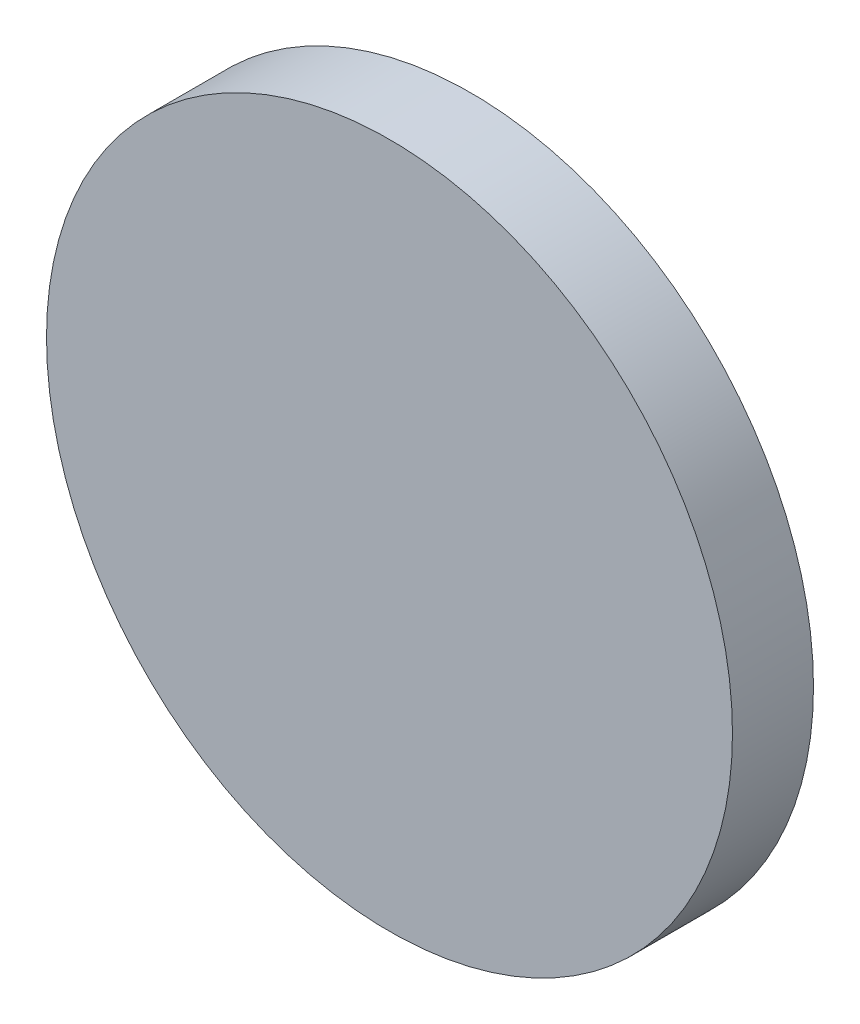
ISO-10303-21;
HEADER;
FILE_DESCRIPTION(('STEP AP214'),'2;1');
FILE_NAME('part.step','',(''),(''),'','','');
FILE_SCHEMA(('AUTOMOTIVE_DESIGN { 1 0 10303 214 1 1 1 1 }'));
ENDSEC;
DATA;
#1=APPLICATION_CONTEXT('core data for automotive mechanical design processes');
#2=APPLICATION_PROTOCOL_DEFINITION('international standard','automotive_design',2000,#1);
#3=PRODUCT_CONTEXT('',#1,'mechanical');
#4=PRODUCT('Part','Part','',(#3));
#5=PRODUCT_RELATED_PRODUCT_CATEGORY('part','',(#4));
#6=PRODUCT_DEFINITION_FORMATION('','',#4);
#7=PRODUCT_DEFINITION_CONTEXT('part definition',#1,'design');
#8=PRODUCT_DEFINITION('design','',#6,#7);
#9=PRODUCT_DEFINITION_SHAPE('','',#8);
#10=(LENGTH_UNIT() NAMED_UNIT(*) SI_UNIT(.MILLI.,.METRE.));
#11=(NAMED_UNIT(*) PLANE_ANGLE_UNIT() SI_UNIT($,.RADIAN.));
#12=(NAMED_UNIT(*) SI_UNIT($,.STERADIAN.) SOLID_ANGLE_UNIT());
#13=UNCERTAINTY_MEASURE_WITH_UNIT(LENGTH_MEASURE(1.E-05),#10,'distance_accuracy_value','');
#14=(GEOMETRIC_REPRESENTATION_CONTEXT(3) GLOBAL_UNCERTAINTY_ASSIGNED_CONTEXT((#13)) GLOBAL_UNIT_ASSIGNED_CONTEXT((#10,
#11,#12)) REPRESENTATION_CONTEXT('',''));
#15=CARTESIAN_POINT('',(0.,0.,0.));
#16=DIRECTION('',(0.,0.,1.));
#17=DIRECTION('',(1.,0.,0.));
#18=AXIS2_PLACEMENT_3D('',#15,#16,#17);
#19=CARTESIAN_POINT('',(0.,0.,3.));
#20=DIRECTION('',(0.,0.,-1.));
#21=DIRECTION('',(-1.,0.,0.));
#22=AXIS2_PLACEMENT_3D('',#19,#20,#21);
#23=CYLINDRICAL_SURFACE('',#22,12.7);
#24=CARTESIAN_POINT('',(0.,0.,3.));
#25=DIRECTION('',(0.,0.,1.));
#26=DIRECTION('',(1.,0.,0.));
#27=AXIS2_PLACEMENT_3D('',#24,#25,#26);
#28=CIRCLE('',#27,12.7);
#29=CARTESIAN_POINT('',(12.7,0.,3.));
#30=VERTEX_POINT('',#29);
#31=EDGE_CURVE('E10',#30,#30,#28,.T.);
#32=ORIENTED_EDGE('',*,*,#31,.F.);
#33=EDGE_LOOP('',(#32));
#34=FACE_BOUND('',#33,.T.);
#35=CARTESIAN_POINT('',(0.,0.,0.));
#36=DIRECTION('',(0.,0.,1.));
#37=DIRECTION('',(1.,0.,0.));
#38=AXIS2_PLACEMENT_3D('',#35,#36,#37);
#39=CIRCLE('',#38,12.7);
#40=CARTESIAN_POINT('',(12.7,0.,0.));
#41=VERTEX_POINT('',#40);
#42=EDGE_CURVE('E36',#41,#41,#39,.T.);
#43=ORIENTED_EDGE('',*,*,#42,.T.);
#44=EDGE_LOOP('',(#43));
#45=FACE_BOUND('',#44,.T.);
#46=ADVANCED_FACE('F30',(#34,#45),#23,.T.);
#47=CARTESIAN_POINT('',(0.,0.,3.));
#48=DIRECTION('',(0.,0.,1.));
#49=DIRECTION('',(1.,0.,0.));
#50=AXIS2_PLACEMENT_3D('',#47,#48,#49);
#51=PLANE('',#50);
#52=ORIENTED_EDGE('',*,*,#31,.T.);
#53=EDGE_LOOP('',(#52));
#54=FACE_BOUND('',#53,.T.);
#55=ADVANCED_FACE('F45',(#54),#51,.T.);
#56=CARTESIAN_POINT('',(0.,0.,0.));
#57=DIRECTION('',(0.,0.,1.));
#58=DIRECTION('',(1.,0.,0.));
#59=AXIS2_PLACEMENT_3D('',#56,#57,#58);
#60=PLANE('',#59);
#61=ORIENTED_EDGE('',*,*,#42,.F.);
#62=EDGE_LOOP('',(#61));
#63=FACE_BOUND('',#62,.T.);
#64=ADVANCED_FACE('F43',(#63),#60,.F.);
#65=CLOSED_SHELL('',(#46,#55,#64));
#66=MANIFOLD_SOLID_BREP('B2',#65);
#67=ADVANCED_BREP_SHAPE_REPRESENTATION('',(#18,#66),#14);
#68=SHAPE_DEFINITION_REPRESENTATION(#9,#67);
ENDSEC;
END-ISO-10303-21;
